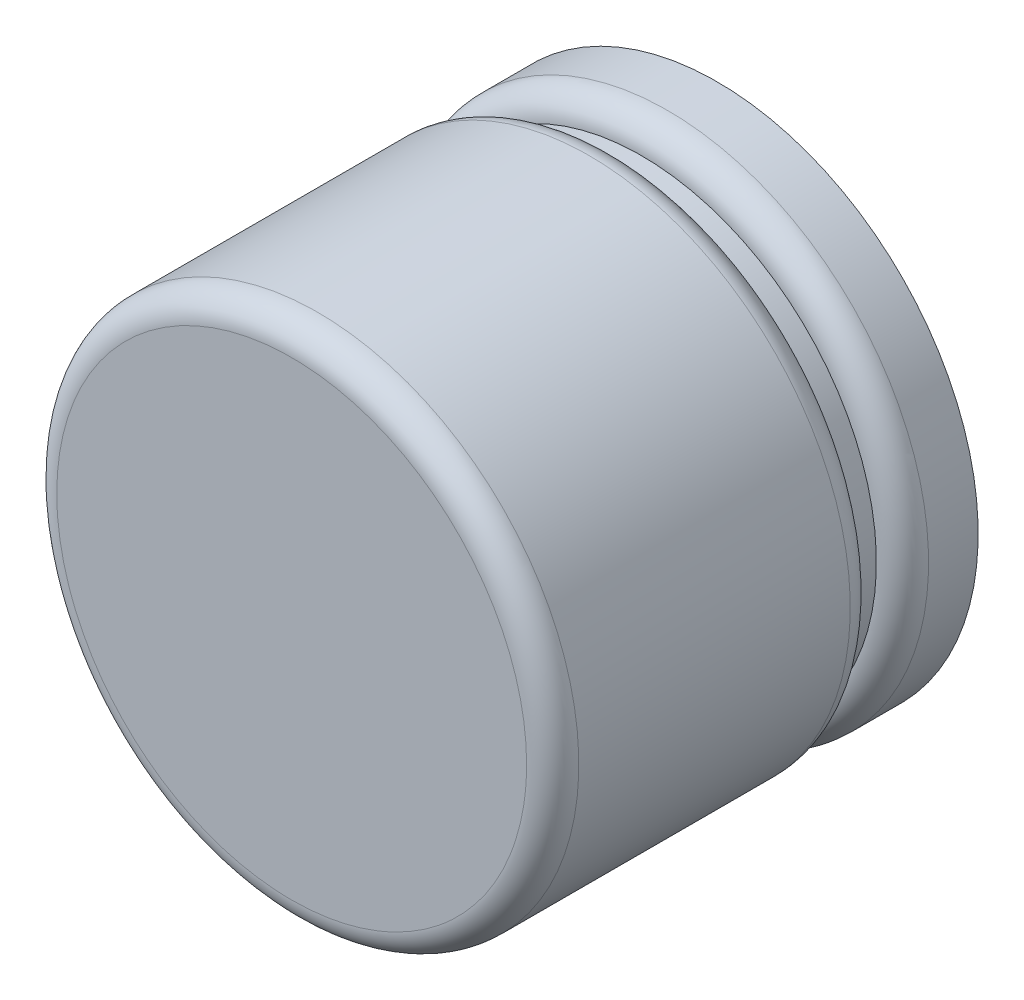
ISO-10303-21;
HEADER;
FILE_DESCRIPTION(('STEP AP214'),'2;1');
FILE_NAME('part.step','',(''),(''),'','','');
FILE_SCHEMA(('AUTOMOTIVE_DESIGN { 1 0 10303 214 1 1 1 1 }'));
ENDSEC;
DATA;
#1=APPLICATION_CONTEXT('core data for automotive mechanical design processes');
#2=APPLICATION_PROTOCOL_DEFINITION('international standard','automotive_design',2000,#1);
#3=PRODUCT_CONTEXT('',#1,'mechanical');
#4=PRODUCT('Part','Part','',(#3));
#5=PRODUCT_RELATED_PRODUCT_CATEGORY('part','',(#4));
#6=PRODUCT_DEFINITION_FORMATION('','',#4);
#7=PRODUCT_DEFINITION_CONTEXT('part definition',#1,'design');
#8=PRODUCT_DEFINITION('design','',#6,#7);
#9=PRODUCT_DEFINITION_SHAPE('','',#8);
#10=(LENGTH_UNIT() NAMED_UNIT(*) SI_UNIT(.MILLI.,.METRE.));
#11=(NAMED_UNIT(*) PLANE_ANGLE_UNIT() SI_UNIT($,.RADIAN.));
#12=(NAMED_UNIT(*) SI_UNIT($,.STERADIAN.) SOLID_ANGLE_UNIT());
#13=UNCERTAINTY_MEASURE_WITH_UNIT(LENGTH_MEASURE(1.E-05),#10,'distance_accuracy_value','');
#14=(GEOMETRIC_REPRESENTATION_CONTEXT(3) GLOBAL_UNCERTAINTY_ASSIGNED_CONTEXT((#13)) GLOBAL_UNIT_ASSIGNED_CONTEXT((#10,
#11,#12)) REPRESENTATION_CONTEXT('',''));
#15=CARTESIAN_POINT('',(0.,0.,0.));
#16=DIRECTION('',(0.,0.,1.));
#17=DIRECTION('',(1.,0.,0.));
#18=AXIS2_PLACEMENT_3D('',#15,#16,#17);
#19=CARTESIAN_POINT('',(-5.99999746,-5.99999746,0.639999985695));
#20=DIRECTION('',(0.,0.,1.));
#21=DIRECTION('',(1.,0.,0.));
#22=AXIS2_PLACEMENT_3D('',#19,#20,#21);
#23=PLANE('',#22);
#24=CARTESIAN_POINT('',(2.54000000055E-06,-1.84279794,0.639999985695));
#25=DIRECTION('',(0.,0.,-1.));
#26=DIRECTION('',(-1.,0.,0.));
#27=AXIS2_PLACEMENT_3D('',#24,#25,#26);
#28=CIRCLE('',#27,2.000000000188);
#29=CARTESIAN_POINT('',(-1.999997460188,-1.84279794,0.639999985695));
#30=VERTEX_POINT('',#29);
#31=EDGE_CURVE('E49',#30,#30,#28,.F.);
#32=ORIENTED_EDGE('',*,*,#31,.F.);
#33=EDGE_LOOP('',(#32));
#34=FACE_BOUND('',#33,.T.);
#35=ADVANCED_FACE('F16',(#34),#23,.F.);
#36=CARTESIAN_POINT('',(2.54000000055E-06,-1.84279794,1.01999996));
#37=DIRECTION('',(0.,0.,-1.));
#38=DIRECTION('',(-1.,0.,0.));
#39=AXIS2_PLACEMENT_3D('',#36,#37,#38);
#40=CYLINDRICAL_SURFACE('',#39,2.000000000188);
#41=CARTESIAN_POINT('',(2.54000000004216E-06,-1.84279794,1.01999996));
#42=DIRECTION('',(0.,0.,-1.));
#43=DIRECTION('',(-1.,0.,0.));
#44=AXIS2_PLACEMENT_3D('',#41,#42,#43);
#45=CIRCLE('',#44,1.99999999965251);
#46=CARTESIAN_POINT('',(-1.99999745965251,-1.84279794,1.01999996));
#47=VERTEX_POINT('',#46);
#48=EDGE_CURVE('E47',#47,#47,#45,.T.);
#49=ORIENTED_EDGE('',*,*,#48,.T.);
#50=EDGE_LOOP('',(#49));
#51=FACE_BOUND('',#50,.T.);
#52=ORIENTED_EDGE('',*,*,#31,.T.);
#53=EDGE_LOOP('',(#52));
#54=FACE_BOUND('',#53,.T.);
#55=ADVANCED_FACE('F82',(#51,#54),#40,.T.);
#56=CARTESIAN_POINT('',(2.54000000004216E-06,-1.84279794,1.01999996));
#57=DIRECTION('',(0.,0.,-1.));
#58=DIRECTION('',(0.,1.,0.));
#59=AXIS2_PLACEMENT_3D('',#56,#57,#58);
#60=TOROIDAL_SURFACE('',#59,1.79999999965258,0.199999999999965);
#61=ORIENTED_EDGE('',*,*,#48,.F.);
#62=EDGE_LOOP('',(#61));
#63=FACE_BOUND('',#62,.T.);
#64=CARTESIAN_POINT('',(2.54000000055E-06,-1.84279794,1.21999996));
#65=DIRECTION('',(0.,0.,-1.));
#66=DIRECTION('',(-1.,0.,0.));
#67=AXIS2_PLACEMENT_3D('',#64,#65,#66);
#68=CIRCLE('',#67,1.799999999653);
#69=CARTESIAN_POINT('',(-1.799997459653,-1.84279794,1.21999996));
#70=VERTEX_POINT('',#69);
#71=EDGE_CURVE('E43',#70,#70,#68,.F.);
#72=ORIENTED_EDGE('',*,*,#71,.F.);
#73=EDGE_LOOP('',(#72));
#74=FACE_BOUND('',#73,.T.);
#75=ADVANCED_FACE('F80',(#63,#74),#60,.T.);
#76=CARTESIAN_POINT('',(-2.42999768,0.6200013,3.89999982));
#77=DIRECTION('',(0.,0.,-1.));
#78=DIRECTION('',(-1.,0.,0.));
#79=AXIS2_PLACEMENT_3D('',#76,#77,#78);
#80=PLANE('',#79);
#81=CARTESIAN_POINT('',(2.54000000055E-06,-1.84279794,3.89999982));
#82=DIRECTION('',(0.,0.,-1.));
#83=DIRECTION('',(-1.,0.,0.));
#84=AXIS2_PLACEMENT_3D('',#81,#82,#83);
#85=CIRCLE('',#84,1.800000000188);
#86=CARTESIAN_POINT('',(-1.799997460188,-1.84279794,3.89999982));
#87=VERTEX_POINT('',#86);
#88=CARTESIAN_POINT('',(1.800002540188,-1.8427979400008,3.89999982));
#89=VERTEX_POINT('',#88);
#90=EDGE_CURVE('E37',#87,#89,#85,.T.);
#91=ORIENTED_EDGE('',*,*,#90,.F.);
#92=CARTESIAN_POINT('',(1.800002540188,-1.842797940001,3.89999982));
#93=CARTESIAN_POINT('',(1.7999877301028,-1.87105992124769,3.8999998171275));
#94=CARTESIAN_POINT('',(1.79931128217376,-1.89932116052203,3.89999981720977));
#95=CARTESIAN_POINT('',(1.79664267919633,-1.95578076388608,3.89999981854989));
#96=CARTESIAN_POINT('',(1.79465055779281,-1.98397912956511,3.89999981980769));
#97=CARTESIAN_POINT('',(1.78935818115825,-2.04025297961683,3.89999981876519));
#98=CARTESIAN_POINT('',(1.78605792901809,-2.0683284642797,3.89999981646489));
#99=CARTESIAN_POINT('',(1.77813754740621,-2.12429309381202,3.89999981680756));
#100=CARTESIAN_POINT('',(1.77351739042307,-2.152182234785,3.89999981945063));
#101=CARTESIAN_POINT('',(1.7652845747543,-2.19582437371202,3.89999975226881));
#102=CARTESIAN_POINT('',(1.76208857448152,-2.21165670575246,3.89999971301242));
#103=CARTESIAN_POINT('',(1.75805925449827,-2.23006862745049,3.89999971596083));
#104=CARTESIAN_POINT('',(1.7574752685991,-2.23270285729563,3.89999971754924));
#105=CARTESIAN_POINT('',(1.75182416619857,-2.25792147618352,3.89999973343427));
#106=CARTESIAN_POINT('',(1.74632106272306,-2.28040939251429,3.89999975281427));
#107=CARTESIAN_POINT('',(1.73048268979271,-2.34010682532016,3.89999979413279));
#108=CARTESIAN_POINT('',(1.71937540750376,-2.37711415900551,3.8999998091302));
#109=CARTESIAN_POINT('',(1.6964082008488,-2.4456254268845,3.89999982165296));
#110=CARTESIAN_POINT('',(1.68482936592511,-2.47722439558517,3.89999982117949));
#111=CARTESIAN_POINT('',(1.65977900541482,-2.54022400178661,3.89999981782376));
#112=CARTESIAN_POINT('',(1.64628130148467,-2.5716142602533,3.89999981490487));
#113=CARTESIAN_POINT('',(1.61914455350136,-2.63010880920594,3.89999976347856));
#114=CARTESIAN_POINT('',(1.60569080857326,-2.65729923520853,3.89999972011593));
#115=CARTESIAN_POINT('',(1.57619066572189,-2.71326909283551,3.89999963092068));
#116=CARTESIAN_POINT('',(1.56002076171569,-2.7419836110102,3.89999958519713));
#117=CARTESIAN_POINT('',(1.52746771174749,-2.79621568599731,3.89999952541436));
#118=CARTESIAN_POINT('',(1.51120463976036,-2.82180546211501,3.89999950911874));
#119=CARTESIAN_POINT('',(1.4788565340168,-2.86993509480257,3.89999951725187));
#120=CARTESIAN_POINT('',(1.46287857297863,-2.89254688669085,3.89999953826856));
#121=CARTESIAN_POINT('',(1.43555026458419,-2.92934813923598,3.89999960423759));
#122=CARTESIAN_POINT('',(1.42449816409005,-2.94375978999929,3.89999963847278));
#123=CARTESIAN_POINT('',(1.40830557309001,-2.96421835841212,3.89999968476343));
#124=CARTESIAN_POINT('',(1.40334107983628,-2.97040529797115,3.89999969845192));
#125=CARTESIAN_POINT('',(1.38025383165228,-2.9987988706784,3.89999975258909));
#126=CARTESIAN_POINT('',(1.36164868977216,-3.02061720035104,3.89999976948715));
#127=CARTESIAN_POINT('',(1.32249741427856,-3.06439762204646,3.89999979042903));
#128=CARTESIAN_POINT('',(1.30190085316936,-3.08631454224233,3.89999979380365));
#129=CARTESIAN_POINT('',(1.25866372830979,-3.13010209763288,3.89999979073032));
#130=CARTESIAN_POINT('',(1.23597263263027,-3.15192284487412,3.89999978381666));
#131=CARTESIAN_POINT('',(1.1884495944362,-3.19530628669766,3.89999975106548));
#132=CARTESIAN_POINT('',(1.16356730406299,-3.21681402340384,3.89999972439736));
#133=CARTESIAN_POINT('',(1.13065608020988,-3.24374159504141,3.89999965445095));
#134=CARTESIAN_POINT('',(1.12313822671092,-3.24979353900123,3.89999963621352));
#135=CARTESIAN_POINT('',(1.09901460979828,-3.26889247246174,3.89999957703641));
#136=CARTESIAN_POINT('',(1.08222383528478,-3.28170723477126,3.89999953486844));
#137=CARTESIAN_POINT('',(1.04093144098847,-3.31206352655561,3.8999994617652));
#138=CARTESIAN_POINT('',(1.01619669584141,-3.32928879605401,3.89999944330019));
#139=CARTESIAN_POINT('',(0.965331019244758,-3.36281754584115,3.89999945768855));
#140=CARTESIAN_POINT('',(0.93918139121348,-3.37909266749087,3.89999949167185));
#141=CARTESIAN_POINT('',(0.89330894742022,-3.40600679245946,3.89999958046656));
#142=CARTESIAN_POINT('',(0.873777446991577,-3.41697275784515,3.89999962707457));
#143=CARTESIAN_POINT('',(0.844757503363475,-3.43255581365903,3.89999968779118));
#144=CARTESIAN_POINT('',(0.835423166947129,-3.43746215381451,3.89999970604729));
#145=CARTESIAN_POINT('',(0.795739287794429,-3.4578826912676,3.89999977156346));
#146=CARTESIAN_POINT('',(0.764988717701737,-3.47262952112698,3.89999979260428));
#147=CARTESIAN_POINT('',(0.706718545170627,-3.49858606042943,3.89999981360111));
#148=CARTESIAN_POINT('',(0.679292191093335,-3.51000675016647,3.89999981592131));
#149=CARTESIAN_POINT('',(0.624968549656687,-3.53110435169,3.89999981639325));
#150=CARTESIAN_POINT('',(0.598090596335062,-3.54083094230148,3.8999998146996));
#151=CARTESIAN_POINT('',(0.548046962960934,-3.55762408971386,3.89999979030214));
#152=CARTESIAN_POINT('',(0.524941276813101,-3.56487002647643,3.89999977084672));
#153=CARTESIAN_POINT('',(0.474577013248309,-3.57953904925307,3.89999973057445));
#154=CARTESIAN_POINT('',(0.447268148847032,-3.5867903608226,3.89999971007117));
#155=CARTESIAN_POINT('',(0.39233753215179,-3.59999058537275,3.89999967901242));
#156=CARTESIAN_POINT('',(0.364715774162288,-3.60593947460545,3.89999966845712));
#157=CARTESIAN_POINT('',(0.309220784148529,-3.61651909655516,3.89999966231825));
#158=CARTESIAN_POINT('',(0.281347552349618,-3.62114983045326,3.89999966673466));
#159=CARTESIAN_POINT('',(0.225413339930933,-3.62908276384328,3.89999968856777));
#160=CARTESIAN_POINT('',(0.197352363081734,-3.63238498993534,3.89999970598421));
#161=CARTESIAN_POINT('',(0.14110638124972,-3.63765509190029,3.89999974619042));
#162=CARTESIAN_POINT('',(0.112921381165818,-3.63962302001006,3.89999976897997));
#163=CARTESIAN_POINT('',(0.056491377978713,-3.64221349324655,3.8999998057231));
#164=CARTESIAN_POINT('',(0.0282463784682934,-3.64283611677711,3.89999981967719));
#165=CARTESIAN_POINT('',(-0.0282314114380099,-3.64275977696298,3.8999998203227));
#166=CARTESIAN_POINT('',(-0.0564642026466196,-3.64206127617632,3.89999980702367));
#167=CARTESIAN_POINT('',(-0.112865594574685,-3.63936979852615,3.89999979253956));
#168=CARTESIAN_POINT('',(-0.141034200416554,-3.6373769288718,3.89999979135348));
#169=CARTESIAN_POINT('',(-0.197248639929134,-3.6320955829564,3.89999980208457));
#170=CARTESIAN_POINT('',(-0.225294477927745,-3.62880715274539,3.89999981400128));
#171=CARTESIAN_POINT('',(-0.281205421635538,-3.62093924075933,3.89999982405627));
#172=CARTESIAN_POINT('',(-0.309070525220174,-3.61635974383573,3.89999982219439));
#173=CARTESIAN_POINT('',(-0.352670897682767,-3.60816844048065,3.89999974125846));
#174=CARTESIAN_POINT('',(-0.36848726253728,-3.60498287163331,3.89999969561279));
#175=CARTESIAN_POINT('',(-0.396087832466264,-3.59902714525202,3.89999959579704));
#176=CARTESIAN_POINT('',(-0.407892616212603,-3.59635191037262,3.89999954660232));
#177=CARTESIAN_POINT('',(-0.447135729332752,-3.58701325575227,3.89999944508194));
#178=CARTESIAN_POINT('',(-0.474443430982807,-3.57978606021165,3.89999947595061));
#179=CARTESIAN_POINT('',(-0.524755953729792,-3.56503933534045,3.89999964515006));
#180=CARTESIAN_POINT('',(-0.547817112457408,-3.55770977449702,3.89999976746402));
#181=CARTESIAN_POINT('',(-0.592866480552712,-3.54250080110853,3.89999985754282));
#182=CARTESIAN_POINT('',(-0.614864189424586,-3.53464922170295,3.89999983051329));
#183=CARTESIAN_POINT('',(-0.678339839899469,-3.51064972548475,3.89999979236651));
#184=CARTESIAN_POINT('',(-0.719421558157377,-3.49342692793817,3.89999981781696));
#185=CARTESIAN_POINT('',(-0.78359165937612,-3.46366831731589,3.89999976989627));
#186=CARTESIAN_POINT('',(-0.80714110463059,-3.4521122235122,3.89999973281516));
#187=CARTESIAN_POINT('',(-0.857589965175284,-3.42595731548926,3.89999965776205));
#188=CARTESIAN_POINT('',(-0.884393473626318,-3.41117239890246,3.8999996206718));
#189=CARTESIAN_POINT('',(-0.937203551729643,-3.38024260682263,3.89999956383108));
#190=CARTESIAN_POINT('',(-0.963210102157183,-3.36409769855812,3.89999954408103));
#191=CARTESIAN_POINT('',(-1.01435845306416,-3.33049101472256,3.89999953225499));
#192=CARTESIAN_POINT('',(-1.03950025511918,-3.31302924155103,3.89999954017895));
#193=CARTESIAN_POINT('',(-1.08884790574548,-3.27683203143533,3.89999957966141));
#194=CARTESIAN_POINT('',(-1.11305378026712,-3.25809662984469,3.89999961121926));
#195=CARTESIAN_POINT('',(-1.16047846633686,-3.21941680280985,3.89999968510186));
#196=CARTESIAN_POINT('',(-1.18369733079323,-3.19947244231079,3.89999972742604));
#197=CARTESIAN_POINT('',(-1.2290351875394,-3.15837427447332,3.89999979297104));
#198=CARTESIAN_POINT('',(-1.25115426723277,-3.1372205635342,3.89999981619337));
#199=CARTESIAN_POINT('',(-1.28303954775598,-3.10534262492083,3.89999982180341));
#200=CARTESIAN_POINT('',(-1.29318087005459,-3.09498810973056,3.89999981924909));
#201=CARTESIAN_POINT('',(-1.3306645298932,-3.05576986807514,3.8999998001794));
#202=CARTESIAN_POINT('',(-1.35717989584097,-3.02610066444053,3.89999976709052));
#203=CARTESIAN_POINT('',(-1.39294891017777,-2.98332394028353,3.89999967905481));
#204=CARTESIAN_POINT('',(-1.40305056734529,-2.97091253337016,3.89999964897983));
#205=CARTESIAN_POINT('',(-1.42714292978077,-2.94048373016054,3.89999957299515));
#206=CARTESIAN_POINT('',(-1.44095972602772,-2.92232785412514,3.89999952579241));
#207=CARTESIAN_POINT('',(-1.47230588599349,-2.87944024294439,3.8999994435702));
#208=CARTESIAN_POINT('',(-1.4895629118441,-2.85450849222004,3.89999941765403));
#209=CARTESIAN_POINT('',(-1.51518260259077,-2.81537188728226,3.89999943381653));
#210=CARTESIAN_POINT('',(-1.52400834498011,-2.80146748607194,3.89999945025003));
#211=CARTESIAN_POINT('',(-1.54527430280252,-2.76691536708353,3.89999949826852));
#212=CARTESIAN_POINT('',(-1.55749283277581,-2.7461305004602,3.89999953334577));
#213=CARTESIAN_POINT('',(-1.5816210781608,-2.70313764803314,3.89999959504116));
#214=CARTESIAN_POINT('',(-1.59349183483627,-2.68090781362134,3.89999962120498));
#215=CARTESIAN_POINT('',(-1.61486322124602,-2.6387803259114,3.89999966657519));
#216=CARTESIAN_POINT('',(-1.62447458296891,-2.61893877851819,3.89999968624249));
#217=CARTESIAN_POINT('',(-1.64164091735552,-2.58177742960552,3.89999971856375));
#218=CARTESIAN_POINT('',(-1.64929343273324,-2.56450265887878,3.8999997318184));
#219=CARTESIAN_POINT('',(-1.66281973450448,-2.53262245847503,3.89999975360378));
#220=CARTESIAN_POINT('',(-1.66877729243107,-2.51805244685271,3.8999997625537));
#221=CARTESIAN_POINT('',(-1.68261239875159,-2.4829119624178,3.8999997808632));
#222=CARTESIAN_POINT('',(-1.69030664821775,-2.46226870451197,3.89999978895921));
#223=CARTESIAN_POINT('',(-1.70084957446237,-2.43230596194211,3.8999998000927));
#224=CARTESIAN_POINT('',(-1.70400694294277,-2.42309358047512,3.89999980343264));
#225=CARTESIAN_POINT('',(-1.71477756941841,-2.39089649394477,3.89999980205681));
#226=CARTESIAN_POINT('',(-1.72203897965939,-2.36779220416006,3.89999977799056));
#227=CARTESIAN_POINT('',(-1.73672204159137,-2.31742574428429,3.89999973605648));
#228=CARTESIAN_POINT('',(-1.74396867513993,-2.2901124100887,3.89999971989035));
#229=CARTESIAN_POINT('',(-1.75716650451602,-2.23517475248288,3.8999996936809));
#230=CARTESIAN_POINT('',(-1.7631176777923,-2.20755042366771,3.89999968363768));
#231=CARTESIAN_POINT('',(-1.77370029371982,-2.15204984074528,3.89999967778677));
#232=CARTESIAN_POINT('',(-1.77833173731852,-2.12417358681892,3.89999968197906));
#233=CARTESIAN_POINT('',(-1.7862673011288,-2.06823343331023,3.89999970178554));
#234=CARTESIAN_POINT('',(-1.78957144634794,-2.04016953727339,3.89999971739951));
#235=CARTESIAN_POINT('',(-1.79484404089093,-1.9839175657211,3.89999975365596));
#236=CARTESIAN_POINT('',(-1.79681253958584,-1.95572949483443,3.89999977429825));
#237=CARTESIAN_POINT('',(-1.79941025766969,-1.89929327142036,3.89999980699372));
#238=CARTESIAN_POINT('',(-1.80003955083616,-1.87104512228852,3.89999981904737));
#239=CARTESIAN_POINT('',(-1.799997460188,-1.84279794,3.89999982));
#240=B_SPLINE_CURVE_WITH_KNOTS('',3,(#92,#93,#94,#95,#96,#97,#98,#99,#100,#101,#102,#103,#104,
#105,#106,#107,#108,#109,#110,#111,#112,#113,#114,#115,#116,#117,#118,#119,#120,#121,#122,#123,
#124,#125,#126,#127,#128,#129,#130,#131,#132,#133,#134,#135,#136,#137,#138,#139,#140,#141,#142,
#143,#144,#145,#146,#147,#148,#149,#150,#151,#152,#153,#154,#155,#156,#157,#158,#159,#160,#161,
#162,#163,#164,#165,#166,#167,#168,#169,#170,#171,#172,#173,#174,#175,#176,#177,#178,#179,#180,
#181,#182,#183,#184,#185,#186,#187,#188,#189,#190,#191,#192,#193,#194,#195,#196,#197,#198,#199,
#200,#201,#202,#203,#204,#205,#206,#207,#208,#209,#210,#211,#212,#213,#214,#215,#216,#217,#218,
#219,#220,#221,#222,#223,#224,#225,#226,#227,#228,#229,#230,#231,#232,#233,#234,#235,#236,#237,
#238,#239),.UNSPECIFIED.,.F.,.F.,(4,2,2,2,2,2,2,2,2,2,2,2,2,2,2,2,2,2,2,2,2,2,2,2,2,2,2,2,2,2,2,
2,2,2,2,2,2,2,2,2,2,2,2,2,2,2,2,2,2,2,2,2,2,2,2,2,2,2,2,2,2,2,2,2,2,2,2,2,2,2,2,2,2,4),(0.,
0.0847775849793268,0.169553002080147,0.254328218873642,0.339105202808129,0.387553697949404,
0.395648239966264,0.465085358900697,0.580913558611753,0.681826754797576,0.784279376307734,
0.875252325309727,0.974062704604733,1.0649849509889,1.14801526499913,1.20249126695214,
1.22628843978366,1.31227458085419,1.40246672286152,1.49686773685403,1.59548091004853,
1.62443371341128,1.68778623622676,1.77817077770201,1.87052988747582,1.93771112985823,
1.96934609958401,2.07159475113267,2.16068987551334,2.24640885942604,2.31903594311703,
2.40376829675703,2.48850219524895,2.57323601781842,2.65796814371525,2.74269695221422,
2.82742082261651,2.91211503460416,2.9968022324874,3.08148642047879,3.16617160214221,
3.21456800279726,3.25087857250562,3.33557818326631,3.40815226378947,3.47821297383933,
3.61171017092476,3.69038547162334,3.78217478957737,3.87396631999424,3.96575768315718,
4.05754649940384,4.14933038912789,4.2411069727822,4.28458660096929,4.40384764487121,
4.45185256246813,4.52028144540428,4.61120087798157,4.66060276928191,4.73291259718911,
4.80849274091054,4.8746186363904,4.93129061287671,4.97850894669154,5.04458281186391,
5.07379760859218,5.14643277234707,5.23117441407183,5.31591753085293,5.4006605867945,
5.48540204602141,5.57014037268,5.65487403093922),.UNSPECIFIED.);
#241=EDGE_CURVE('E34',#89,#87,#240,.T.);
#242=ORIENTED_EDGE('',*,*,#241,.F.);
#243=EDGE_LOOP('',(#91,#242));
#244=FACE_BOUND('',#243,.T.);
#245=ADVANCED_FACE('F39',(#244),#80,.F.);
#246=CARTESIAN_POINT('',(2.54000000055E-06,-1.84279794,1.41999996));
#247=DIRECTION('',(0.,0.,-1.));
#248=DIRECTION('',(-1.,0.,0.));
#249=AXIS2_PLACEMENT_3D('',#246,#247,#248);
#250=CYLINDRICAL_SURFACE('',#249,1.799999999653);
#251=ORIENTED_EDGE('',*,*,#71,.T.);
#252=EDGE_LOOP('',(#251));
#253=FACE_BOUND('',#252,.T.);
#254=CARTESIAN_POINT('',(2.54000000004216E-06,-1.84279794,1.419999959999));
#255=DIRECTION('',(0.,0.,-1.));
#256=DIRECTION('',(-1.,0.,0.));
#257=AXIS2_PLACEMENT_3D('',#254,#255,#256);
#258=CIRCLE('',#257,1.79999999965258);
#259=CARTESIAN_POINT('',(-1.79999745965258,-1.84279794,1.419999959999));
#260=VERTEX_POINT('',#259);
#261=EDGE_CURVE('E42',#260,#260,#258,.T.);
#262=ORIENTED_EDGE('',*,*,#261,.T.);
#263=EDGE_LOOP('',(#262));
#264=FACE_BOUND('',#263,.T.);
#265=ADVANCED_FACE('F67',(#253,#264),#250,.T.);
#266=CARTESIAN_POINT('',(2.54000000055E-06,-1.84279794,3.69999982));
#267=DIRECTION('',(0.,0.,1.));
#268=DIRECTION('',(-1.,0.,0.));
#269=AXIS2_PLACEMENT_3D('',#266,#267,#268);
#270=TOROIDAL_SURFACE('',#269,1.800000000188,0.2);
#271=CARTESIAN_POINT('',(2.54000000055E-06,-1.84279794,3.69999982));
#272=DIRECTION('',(0.,0.,-1.));
#273=DIRECTION('',(-1.,0.,0.));
#274=AXIS2_PLACEMENT_3D('',#271,#272,#273);
#275=CIRCLE('',#274,2.000000000188);
#276=CARTESIAN_POINT('',(-1.999997460188,-1.84279794,3.69999982));
#277=VERTEX_POINT('',#276);
#278=EDGE_CURVE('E27',#277,#277,#275,.T.);
#279=ORIENTED_EDGE('',*,*,#278,.F.);
#280=EDGE_LOOP('',(#279));
#281=FACE_BOUND('',#280,.T.);
#282=ORIENTED_EDGE('',*,*,#90,.T.);
#283=ORIENTED_EDGE('',*,*,#241,.T.);
#284=EDGE_LOOP('',(#282,#283));
#285=FACE_BOUND('',#284,.T.);
#286=ADVANCED_FACE('F46',(#281,#285),#270,.T.);
#287=CARTESIAN_POINT('',(2.54000000004216E-06,-1.84279794,1.61999996));
#288=DIRECTION('',(0.,0.,-1.));
#289=DIRECTION('',(0.,1.,0.));
#290=AXIS2_PLACEMENT_3D('',#287,#288,#289);
#291=TOROIDAL_SURFACE('',#290,1.79999999965258,0.200000000001143);
#292=ORIENTED_EDGE('',*,*,#261,.F.);
#293=EDGE_LOOP('',(#292));
#294=FACE_BOUND('',#293,.T.);
#295=CARTESIAN_POINT('',(2.54000000055E-06,-1.84279794,1.61999996));
#296=DIRECTION('',(0.,0.,-1.));
#297=DIRECTION('',(-1.,0.,0.));
#298=AXIS2_PLACEMENT_3D('',#295,#296,#297);
#299=CIRCLE('',#298,2.000000000188);
#300=CARTESIAN_POINT('',(-1.999997460188,-1.84279794,1.61999996));
#301=VERTEX_POINT('',#300);
#302=EDGE_CURVE('E11',#301,#301,#299,.F.);
#303=ORIENTED_EDGE('',*,*,#302,.F.);
#304=EDGE_LOOP('',(#303));
#305=FACE_BOUND('',#304,.T.);
#306=ADVANCED_FACE('F18',(#294,#305),#291,.T.);
#307=CARTESIAN_POINT('',(2.54000000055E-06,-1.84279794,5.21999996));
#308=DIRECTION('',(0.,0.,-1.));
#309=DIRECTION('',(-1.,0.,0.));
#310=AXIS2_PLACEMENT_3D('',#307,#308,#309);
#311=CYLINDRICAL_SURFACE('',#310,2.000000000188);
#312=ORIENTED_EDGE('',*,*,#278,.T.);
#313=EDGE_LOOP('',(#312));
#314=FACE_BOUND('',#313,.T.);
#315=ORIENTED_EDGE('',*,*,#302,.T.);
#316=EDGE_LOOP('',(#315));
#317=FACE_BOUND('',#316,.T.);
#318=ADVANCED_FACE('F69',(#314,#317),#311,.T.);
#319=CLOSED_SHELL('',(#35,#55,#75,#245,#265,#286,#306,#318));
#320=MANIFOLD_SOLID_BREP('B1',#319);
#321=ADVANCED_BREP_SHAPE_REPRESENTATION('',(#18,#320),#14);
#322=SHAPE_DEFINITION_REPRESENTATION(#9,#321);
ENDSEC;
END-ISO-10303-21;
